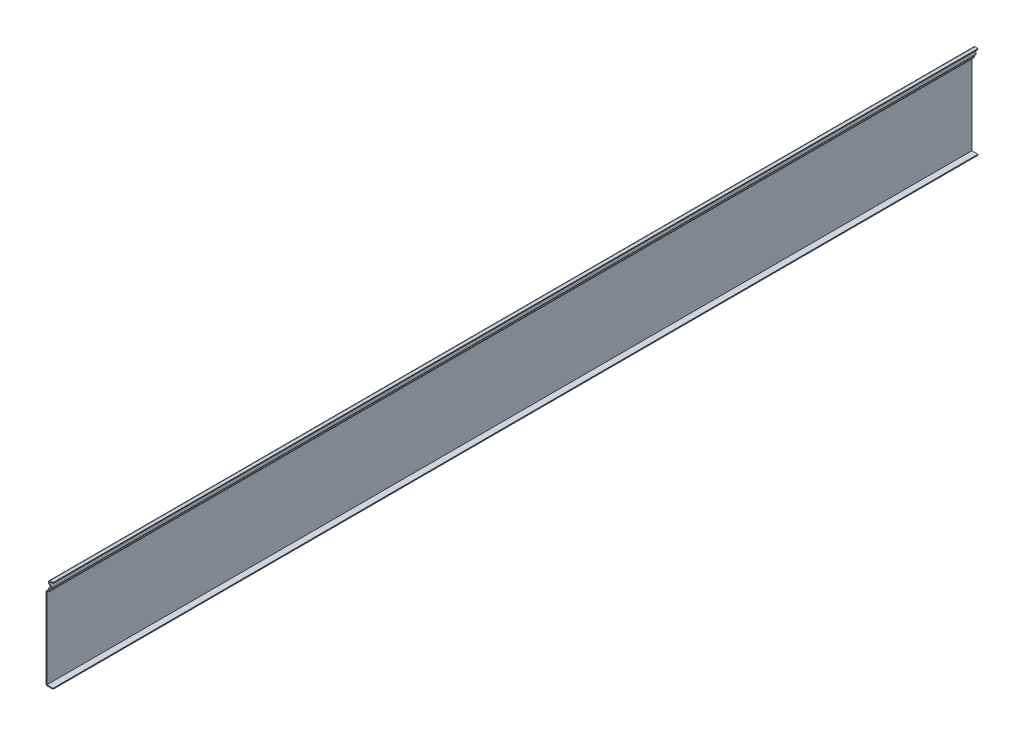
ISO-10303-21;
HEADER;
FILE_DESCRIPTION(('STEP AP214'),'2;1');
FILE_NAME('part.step','',(''),(''),'','','');
FILE_SCHEMA(('AUTOMOTIVE_DESIGN { 1 0 10303 214 1 1 1 1 }'));
ENDSEC;
DATA;
#1=APPLICATION_CONTEXT('core data for automotive mechanical design processes');
#2=APPLICATION_PROTOCOL_DEFINITION('international standard','automotive_design',2000,#1);
#3=PRODUCT_CONTEXT('',#1,'mechanical');
#4=PRODUCT('Part','Part','',(#3));
#5=PRODUCT_RELATED_PRODUCT_CATEGORY('part','',(#4));
#6=PRODUCT_DEFINITION_FORMATION('','',#4);
#7=PRODUCT_DEFINITION_CONTEXT('part definition',#1,'design');
#8=PRODUCT_DEFINITION('design','',#6,#7);
#9=PRODUCT_DEFINITION_SHAPE('','',#8);
#10=(LENGTH_UNIT() NAMED_UNIT(*) SI_UNIT(.MILLI.,.METRE.));
#11=(NAMED_UNIT(*) PLANE_ANGLE_UNIT() SI_UNIT($,.RADIAN.));
#12=(NAMED_UNIT(*) SI_UNIT($,.STERADIAN.) SOLID_ANGLE_UNIT());
#13=UNCERTAINTY_MEASURE_WITH_UNIT(LENGTH_MEASURE(1.E-05),#10,'distance_accuracy_value','');
#14=(GEOMETRIC_REPRESENTATION_CONTEXT(3) GLOBAL_UNCERTAINTY_ASSIGNED_CONTEXT((#13)) GLOBAL_UNIT_ASSIGNED_CONTEXT((#10,
#11,#12)) REPRESENTATION_CONTEXT('',''));
#15=CARTESIAN_POINT('',(0.,0.,0.));
#16=DIRECTION('',(0.,0.,1.));
#17=DIRECTION('',(1.,0.,0.));
#18=AXIS2_PLACEMENT_3D('',#15,#16,#17);
#19=CARTESIAN_POINT('',(-3.79778394209355,124.1425,-1254.125));
#20=DIRECTION('',(0.,-1.,0.));
#21=DIRECTION('',(0.,0.,-1.));
#22=AXIS2_PLACEMENT_3D('',#19,#20,#21);
#23=PLANE('',#22);
#24=DIRECTION('',(1.,0.,0.));
#25=VECTOR('',#24,1.);
#26=CARTESIAN_POINT('',(-3.79778394209355,124.1425,0.));
#27=LINE('',#26,#25);
#28=CARTESIAN_POINT('',(-3.79778394209355,124.1425,0.));
#29=VERTEX_POINT('',#28);
#30=CARTESIAN_POINT('',(0.,124.1425,0.));
#31=VERTEX_POINT('',#30);
#32=EDGE_CURVE('E227',#29,#31,#27,.T.);
#33=ORIENTED_EDGE('',*,*,#32,.F.);
#34=DIRECTION('',(0.,0.,1.));
#35=VECTOR('',#34,1.);
#36=CARTESIAN_POINT('',(-3.79778394209355,124.1425,-1254.125));
#37=LINE('',#36,#35);
#38=CARTESIAN_POINT('',(-3.79778394209355,124.1425,-1254.125));
#39=VERTEX_POINT('',#38);
#40=EDGE_CURVE('E190',#39,#29,#37,.T.);
#41=ORIENTED_EDGE('',*,*,#40,.F.);
#42=DIRECTION('',(1.,0.,0.));
#43=VECTOR('',#42,1.);
#44=CARTESIAN_POINT('',(-3.79778394209355,124.1425,-1254.125));
#45=LINE('',#44,#43);
#46=CARTESIAN_POINT('',(0.,124.1425,-1254.125));
#47=VERTEX_POINT('',#46);
#48=EDGE_CURVE('E171',#39,#47,#45,.T.);
#49=ORIENTED_EDGE('',*,*,#48,.T.);
#50=DIRECTION('',(0.,0.,1.));
#51=VECTOR('',#50,1.);
#52=CARTESIAN_POINT('',(0.,124.1425,-1254.125));
#53=LINE('',#52,#51);
#54=EDGE_CURVE('E180',#47,#31,#53,.T.);
#55=ORIENTED_EDGE('',*,*,#54,.T.);
#56=EDGE_LOOP('',(#33,#41,#49,#55));
#57=FACE_BOUND('',#56,.T.);
#58=ADVANCED_FACE('F35',(#57),#23,.T.);
#59=CARTESIAN_POINT('',(-3.79778394209355,122.860283942094,-1254.125));
#60=DIRECTION('',(0.,0.,1.));
#61=DIRECTION('',(1.,0.,0.));
#62=AXIS2_PLACEMENT_3D('',#59,#60,#61);
#63=CYLINDRICAL_SURFACE('',#62,1.28221605790645);
#64=CARTESIAN_POINT('',(-3.79778394209355,122.860283942094,0.));
#65=DIRECTION('',(0.,0.,1.));
#66=DIRECTION('',(1.,0.,0.));
#67=AXIS2_PLACEMENT_3D('',#64,#65,#66);
#68=CIRCLE('',#67,1.28221605790645);
#69=CARTESIAN_POINT('',(-4.43889197104677,121.749852262806,0.));
#70=VERTEX_POINT('',#69);
#71=EDGE_CURVE('E191',#70,#29,#68,.F.);
#72=ORIENTED_EDGE('',*,*,#71,.F.);
#73=DIRECTION('',(0.,0.,1.));
#74=VECTOR('',#73,1.);
#75=CARTESIAN_POINT('',(-4.43889197104677,121.749852262806,-1254.125));
#76=LINE('',#75,#74);
#77=CARTESIAN_POINT('',(-4.43889197104677,121.749852262806,-1254.125));
#78=VERTEX_POINT('',#77);
#79=EDGE_CURVE('E262',#78,#70,#76,.T.);
#80=ORIENTED_EDGE('',*,*,#79,.F.);
#81=CARTESIAN_POINT('',(-3.79778394209355,122.860283942094,-1254.125));
#82=DIRECTION('',(0.,0.,1.));
#83=DIRECTION('',(1.,0.,0.));
#84=AXIS2_PLACEMENT_3D('',#81,#82,#83);
#85=CIRCLE('',#84,1.28221605790645);
#86=EDGE_CURVE('E188',#78,#39,#85,.F.);
#87=ORIENTED_EDGE('',*,*,#86,.T.);
#88=ORIENTED_EDGE('',*,*,#40,.T.);
#89=EDGE_LOOP('',(#72,#80,#87,#88));
#90=FACE_BOUND('',#89,.T.);
#91=ADVANCED_FACE('F330',(#90),#63,.F.);
#92=CARTESIAN_POINT('',(-6.35,118.439716057906,-1254.125));
#93=DIRECTION('',(0.,0.,1.));
#94=DIRECTION('',(1.,0.,0.));
#95=AXIS2_PLACEMENT_3D('',#92,#93,#94);
#96=CYLINDRICAL_SURFACE('',#95,3.82221605790645);
#97=CARTESIAN_POINT('',(-6.35,118.439716057906,0.));
#98=DIRECTION('',(0.,0.,1.));
#99=DIRECTION('',(1.,0.,0.));
#100=AXIS2_PLACEMENT_3D('',#97,#98,#99);
#101=CIRCLE('',#100,3.82221605790645);
#102=CARTESIAN_POINT('',(-5.08,114.834659110601,0.));
#103=VERTEX_POINT('',#102);
#104=EDGE_CURVE('E194',#103,#70,#101,.T.);
#105=ORIENTED_EDGE('',*,*,#104,.F.);
#106=DIRECTION('',(0.,0.,1.));
#107=VECTOR('',#106,1.);
#108=CARTESIAN_POINT('',(-5.08,114.834659110601,-1254.125));
#109=LINE('',#108,#107);
#110=CARTESIAN_POINT('',(-5.08,114.834659110601,-1254.125));
#111=VERTEX_POINT('',#110);
#112=EDGE_CURVE('E264',#111,#103,#109,.T.);
#113=ORIENTED_EDGE('',*,*,#112,.F.);
#114=CARTESIAN_POINT('',(-6.35,118.439716057906,-1254.125));
#115=DIRECTION('',(0.,0.,1.));
#116=DIRECTION('',(1.,0.,0.));
#117=AXIS2_PLACEMENT_3D('',#114,#115,#116);
#118=CIRCLE('',#117,3.82221605790645);
#119=EDGE_CURVE('E223',#111,#78,#118,.T.);
#120=ORIENTED_EDGE('',*,*,#119,.T.);
#121=ORIENTED_EDGE('',*,*,#79,.T.);
#122=EDGE_LOOP('',(#105,#113,#120,#121));
#123=FACE_BOUND('',#122,.T.);
#124=ADVANCED_FACE('F336',(#123),#96,.T.);
#125=CARTESIAN_POINT('',(-5.08,112.7125,-1254.125));
#126=DIRECTION('',(1.,0.,0.));
#127=DIRECTION('',(0.,1.,0.));
#128=AXIS2_PLACEMENT_3D('',#125,#126,#127);
#129=PLANE('',#128);
#130=DIRECTION('',(0.,1.,0.));
#131=VECTOR('',#130,1.);
#132=CARTESIAN_POINT('',(-5.08,112.7125,0.));
#133=LINE('',#132,#131);
#134=CARTESIAN_POINT('',(-5.08,112.7125,0.));
#135=VERTEX_POINT('',#134);
#136=EDGE_CURVE('E256',#135,#103,#133,.T.);
#137=ORIENTED_EDGE('',*,*,#136,.F.);
#138=DIRECTION('',(0.,0.,1.));
#139=VECTOR('',#138,1.);
#140=CARTESIAN_POINT('',(-5.08,112.7125,-1254.125));
#141=LINE('',#140,#139);
#142=CARTESIAN_POINT('',(-5.08,112.7125,-1254.125));
#143=VERTEX_POINT('',#142);
#144=EDGE_CURVE('E307',#135,#143,#141,.F.);
#145=ORIENTED_EDGE('',*,*,#144,.T.);
#146=DIRECTION('',(0.,1.,0.));
#147=VECTOR('',#146,1.);
#148=CARTESIAN_POINT('',(-5.08,112.7125,-1254.125));
#149=LINE('',#148,#147);
#150=EDGE_CURVE('E221',#143,#111,#149,.T.);
#151=ORIENTED_EDGE('',*,*,#150,.T.);
#152=ORIENTED_EDGE('',*,*,#112,.T.);
#153=EDGE_LOOP('',(#137,#145,#151,#152));
#154=FACE_BOUND('',#153,.T.);
#155=ADVANCED_FACE('F339',(#154),#129,.T.);
#156=CARTESIAN_POINT('',(-6.35,109.5375,-1254.125));
#157=DIRECTION('',(0.,0.,1.));
#158=DIRECTION('',(1.,0.,0.));
#159=AXIS2_PLACEMENT_3D('',#156,#157,#158);
#160=CYLINDRICAL_SURFACE('',#159,1.90500000000004);
#161=CARTESIAN_POINT('',(-6.35,109.5375,-1254.125));
#162=DIRECTION('',(0.,0.,1.));
#163=DIRECTION('',(1.,0.,0.));
#164=AXIS2_PLACEMENT_3D('',#161,#162,#163);
#165=CIRCLE('',#164,1.90500000000004);
#166=CARTESIAN_POINT('',(-8.25500000000004,109.5375,-1254.125));
#167=VERTEX_POINT('',#166);
#168=CARTESIAN_POINT('',(-6.35,111.4425,-1254.125));
#169=VERTEX_POINT('',#168);
#170=EDGE_CURVE('E218',#167,#169,#165,.F.);
#171=ORIENTED_EDGE('',*,*,#170,.T.);
#172=DIRECTION('',(0.,0.,1.));
#173=VECTOR('',#172,1.);
#174=CARTESIAN_POINT('',(-6.35,111.4425,-1254.125));
#175=LINE('',#174,#173);
#176=CARTESIAN_POINT('',(-6.35,111.4425,0.));
#177=VERTEX_POINT('',#176);
#178=EDGE_CURVE('E304',#169,#177,#175,.T.);
#179=ORIENTED_EDGE('',*,*,#178,.T.);
#180=CARTESIAN_POINT('',(-6.35,109.5375,0.));
#181=DIRECTION('',(0.,0.,1.));
#182=DIRECTION('',(1.,0.,0.));
#183=AXIS2_PLACEMENT_3D('',#180,#181,#182);
#184=CIRCLE('',#183,1.90500000000004);
#185=CARTESIAN_POINT('',(-8.25500000000004,109.5375,0.));
#186=VERTEX_POINT('',#185);
#187=EDGE_CURVE('E253',#186,#177,#184,.F.);
#188=ORIENTED_EDGE('',*,*,#187,.F.);
#189=DIRECTION('',(0.,0.,1.));
#190=VECTOR('',#189,1.);
#191=CARTESIAN_POINT('',(-8.25500000000004,109.5375,-1254.125));
#192=LINE('',#191,#190);
#193=EDGE_CURVE('E267',#167,#186,#192,.T.);
#194=ORIENTED_EDGE('',*,*,#193,.F.);
#195=EDGE_LOOP('',(#171,#179,#188,#194));
#196=FACE_BOUND('',#195,.T.);
#197=ADVANCED_FACE('F347',(#196),#160,.F.);
#198=CARTESIAN_POINT('',(-8.255,0.,-1254.125));
#199=DIRECTION('',(1.,0.,0.));
#200=DIRECTION('',(0.,0.,-1.));
#201=AXIS2_PLACEMENT_3D('',#198,#199,#200);
#202=PLANE('',#201);
#203=DIRECTION('',(0.,1.,0.));
#204=VECTOR('',#203,1.);
#205=CARTESIAN_POINT('',(-8.255,0.,0.));
#206=LINE('',#205,#204);
#207=CARTESIAN_POINT('',(-8.255,1.27,0.));
#208=VERTEX_POINT('',#207);
#209=EDGE_CURVE('E250',#208,#186,#206,.T.);
#210=ORIENTED_EDGE('',*,*,#209,.F.);
#211=DIRECTION('',(0.,0.,1.));
#212=VECTOR('',#211,1.);
#213=CARTESIAN_POINT('',(-8.255,1.27,-1254.125));
#214=LINE('',#213,#212);
#215=CARTESIAN_POINT('',(-8.255,1.27,-1254.125));
#216=VERTEX_POINT('',#215);
#217=EDGE_CURVE('E269',#216,#208,#214,.T.);
#218=ORIENTED_EDGE('',*,*,#217,.F.);
#219=DIRECTION('',(0.,1.,0.));
#220=VECTOR('',#219,1.);
#221=CARTESIAN_POINT('',(-8.255,0.,-1254.125));
#222=LINE('',#221,#220);
#223=EDGE_CURVE('E215',#216,#167,#222,.T.);
#224=ORIENTED_EDGE('',*,*,#223,.T.);
#225=ORIENTED_EDGE('',*,*,#193,.T.);
#226=EDGE_LOOP('',(#210,#218,#224,#225));
#227=FACE_BOUND('',#226,.T.);
#228=ADVANCED_FACE('F351',(#227),#202,.T.);
#229=CARTESIAN_POINT('',(0.,1.27,-1254.125));
#230=DIRECTION('',(0.,1.,0.));
#231=DIRECTION('',(0.,0.,1.));
#232=AXIS2_PLACEMENT_3D('',#229,#230,#231);
#233=PLANE('',#232);
#234=DIRECTION('',(1.,0.,0.));
#235=VECTOR('',#234,1.);
#236=CARTESIAN_POINT('',(0.,1.27,0.));
#237=LINE('',#236,#235);
#238=CARTESIAN_POINT('',(0.,1.27,0.));
#239=VERTEX_POINT('',#238);
#240=EDGE_CURVE('E247',#239,#208,#237,.F.);
#241=ORIENTED_EDGE('',*,*,#240,.F.);
#242=DIRECTION('',(0.,0.,1.));
#243=VECTOR('',#242,1.);
#244=CARTESIAN_POINT('',(0.,1.27,-1254.125));
#245=LINE('',#244,#243);
#246=CARTESIAN_POINT('',(0.,1.27,-1254.125));
#247=VERTEX_POINT('',#246);
#248=EDGE_CURVE('E271',#247,#239,#245,.T.);
#249=ORIENTED_EDGE('',*,*,#248,.F.);
#250=DIRECTION('',(1.,0.,0.));
#251=VECTOR('',#250,1.);
#252=CARTESIAN_POINT('',(0.,1.27,-1254.125));
#253=LINE('',#252,#251);
#254=EDGE_CURVE('E212',#247,#216,#253,.F.);
#255=ORIENTED_EDGE('',*,*,#254,.T.);
#256=ORIENTED_EDGE('',*,*,#217,.T.);
#257=EDGE_LOOP('',(#241,#249,#255,#256));
#258=FACE_BOUND('',#257,.T.);
#259=ADVANCED_FACE('F355',(#258),#233,.T.);
#260=CARTESIAN_POINT('',(0.,1.27,-1254.125));
#261=DIRECTION('',(-1.,0.,0.));
#262=DIRECTION('',(0.,0.,1.));
#263=AXIS2_PLACEMENT_3D('',#260,#261,#262);
#264=PLANE('',#263);
#265=DIRECTION('',(0.,-1.,0.));
#266=VECTOR('',#265,1.);
#267=CARTESIAN_POINT('',(0.,1.27,0.));
#268=LINE('',#267,#266);
#269=CARTESIAN_POINT('',(0.,0.,0.));
#270=VERTEX_POINT('',#269);
#271=EDGE_CURVE('E245',#239,#270,#268,.T.);
#272=ORIENTED_EDGE('',*,*,#271,.T.);
#273=DIRECTION('',(0.,0.,1.));
#274=VECTOR('',#273,1.);
#275=CARTESIAN_POINT('',(0.,0.,-1254.125));
#276=LINE('',#275,#274);
#277=CARTESIAN_POINT('',(0.,0.,-1254.125));
#278=VERTEX_POINT('',#277);
#279=EDGE_CURVE('E273',#278,#270,#276,.T.);
#280=ORIENTED_EDGE('',*,*,#279,.F.);
#281=DIRECTION('',(0.,-1.,0.));
#282=VECTOR('',#281,1.);
#283=CARTESIAN_POINT('',(0.,1.27,-1254.125));
#284=LINE('',#283,#282);
#285=EDGE_CURVE('E210',#247,#278,#284,.T.);
#286=ORIENTED_EDGE('',*,*,#285,.F.);
#287=ORIENTED_EDGE('',*,*,#248,.T.);
#288=EDGE_LOOP('',(#272,#280,#286,#287));
#289=FACE_BOUND('',#288,.T.);
#290=ADVANCED_FACE('F360',(#289),#264,.F.);
#291=CARTESIAN_POINT('',(0.,0.,-1254.125));
#292=DIRECTION('',(0.,1.,0.));
#293=DIRECTION('',(0.,0.,1.));
#294=AXIS2_PLACEMENT_3D('',#291,#292,#293);
#295=PLANE('',#294);
#296=DIRECTION('',(-1.,0.,0.));
#297=VECTOR('',#296,1.);
#298=CARTESIAN_POINT('',(0.,0.,0.));
#299=LINE('',#298,#297);
#300=CARTESIAN_POINT('',(-8.255,0.,0.));
#301=VERTEX_POINT('',#300);
#302=EDGE_CURVE('E242',#270,#301,#299,.T.);
#303=ORIENTED_EDGE('',*,*,#302,.T.);
#304=DIRECTION('',(0.,0.,1.));
#305=VECTOR('',#304,1.);
#306=CARTESIAN_POINT('',(-8.255,0.,-1254.125));
#307=LINE('',#306,#305);
#308=CARTESIAN_POINT('',(-8.255,0.,-1254.125));
#309=VERTEX_POINT('',#308);
#310=EDGE_CURVE('E297',#301,#309,#307,.F.);
#311=ORIENTED_EDGE('',*,*,#310,.T.);
#312=DIRECTION('',(-1.,0.,0.));
#313=VECTOR('',#312,1.);
#314=CARTESIAN_POINT('',(0.,0.,-1254.125));
#315=LINE('',#314,#313);
#316=EDGE_CURVE('E208',#278,#309,#315,.T.);
#317=ORIENTED_EDGE('',*,*,#316,.F.);
#318=ORIENTED_EDGE('',*,*,#279,.T.);
#319=EDGE_LOOP('',(#303,#311,#317,#318));
#320=FACE_BOUND('',#319,.T.);
#321=ADVANCED_FACE('F414',(#320),#295,.F.);
#322=CARTESIAN_POINT('',(-9.525,0.,-1254.125));
#323=DIRECTION('',(1.,0.,0.));
#324=DIRECTION('',(0.,0.,-1.));
#325=AXIS2_PLACEMENT_3D('',#322,#323,#324);
#326=PLANE('',#325);
#327=DIRECTION('',(0.,1.,0.));
#328=VECTOR('',#327,1.);
#329=CARTESIAN_POINT('',(-9.525,0.,-1254.125));
#330=LINE('',#329,#328);
#331=CARTESIAN_POINT('',(-9.525,1.27,-1254.125));
#332=VERTEX_POINT('',#331);
#333=CARTESIAN_POINT('',(-9.525,109.5375,-1254.125));
#334=VERTEX_POINT('',#333);
#335=EDGE_CURVE('E206',#332,#334,#330,.T.);
#336=ORIENTED_EDGE('',*,*,#335,.F.);
#337=DIRECTION('',(0.,0.,1.));
#338=VECTOR('',#337,1.);
#339=CARTESIAN_POINT('',(-9.525,1.27,-1254.125));
#340=LINE('',#339,#338);
#341=CARTESIAN_POINT('',(-9.525,1.27,0.));
#342=VERTEX_POINT('',#341);
#343=EDGE_CURVE('E261',#332,#342,#340,.T.);
#344=ORIENTED_EDGE('',*,*,#343,.T.);
#345=DIRECTION('',(0.,1.,0.));
#346=VECTOR('',#345,1.);
#347=CARTESIAN_POINT('',(-9.525,0.,0.));
#348=LINE('',#347,#346);
#349=CARTESIAN_POINT('',(-9.525,109.5375,0.));
#350=VERTEX_POINT('',#349);
#351=EDGE_CURVE('E240',#342,#350,#348,.T.);
#352=ORIENTED_EDGE('',*,*,#351,.T.);
#353=DIRECTION('',(0.,0.,1.));
#354=VECTOR('',#353,1.);
#355=CARTESIAN_POINT('',(-9.525,109.5375,-1254.125));
#356=LINE('',#355,#354);
#357=EDGE_CURVE('E276',#334,#350,#356,.T.);
#358=ORIENTED_EDGE('',*,*,#357,.F.);
#359=EDGE_LOOP('',(#336,#344,#352,#358));
#360=FACE_BOUND('',#359,.T.);
#361=ADVANCED_FACE('F370',(#360),#326,.F.);
#362=CARTESIAN_POINT('',(-6.35,109.5375,-1254.125));
#363=DIRECTION('',(0.,0.,1.));
#364=DIRECTION('',(1.,0.,0.));
#365=AXIS2_PLACEMENT_3D('',#362,#363,#364);
#366=CYLINDRICAL_SURFACE('',#365,3.17500000000004);
#367=CARTESIAN_POINT('',(-6.35,109.5375,0.));
#368=DIRECTION('',(0.,0.,-1.));
#369=DIRECTION('',(-1.,0.,0.));
#370=AXIS2_PLACEMENT_3D('',#367,#368,#369);
#371=CIRCLE('',#370,3.17500000000004);
#372=CARTESIAN_POINT('',(-6.35,112.7125,0.));
#373=VERTEX_POINT('',#372);
#374=EDGE_CURVE('E238',#350,#373,#371,.T.);
#375=ORIENTED_EDGE('',*,*,#374,.T.);
#376=DIRECTION('',(0.,0.,1.));
#377=VECTOR('',#376,1.);
#378=CARTESIAN_POINT('',(-6.35,112.7125,-1254.125));
#379=LINE('',#378,#377);
#380=CARTESIAN_POINT('',(-6.35,112.7125,-1254.125));
#381=VERTEX_POINT('',#380);
#382=EDGE_CURVE('E279',#381,#373,#379,.T.);
#383=ORIENTED_EDGE('',*,*,#382,.F.);
#384=CARTESIAN_POINT('',(-6.35,109.5375,-1254.125));
#385=DIRECTION('',(0.,0.,-1.));
#386=DIRECTION('',(-1.,0.,0.));
#387=AXIS2_PLACEMENT_3D('',#384,#385,#386);
#388=CIRCLE('',#387,3.17500000000004);
#389=EDGE_CURVE('E204',#334,#381,#388,.T.);
#390=ORIENTED_EDGE('',*,*,#389,.F.);
#391=ORIENTED_EDGE('',*,*,#357,.T.);
#392=EDGE_LOOP('',(#375,#383,#390,#391));
#393=FACE_BOUND('',#392,.T.);
#394=ADVANCED_FACE('F376',(#393),#366,.T.);
#395=CARTESIAN_POINT('',(-6.35,112.7125,-1254.125));
#396=DIRECTION('',(1.,0.,0.));
#397=DIRECTION('',(0.,1.,0.));
#398=AXIS2_PLACEMENT_3D('',#395,#396,#397);
#399=PLANE('',#398);
#400=DIRECTION('',(0.,1.,0.));
#401=VECTOR('',#400,1.);
#402=CARTESIAN_POINT('',(-6.35,112.7125,0.));
#403=LINE('',#402,#401);
#404=CARTESIAN_POINT('',(-6.35,114.834659110601,0.));
#405=VERTEX_POINT('',#404);
#406=EDGE_CURVE('E236',#373,#405,#403,.T.);
#407=ORIENTED_EDGE('',*,*,#406,.T.);
#408=DIRECTION('',(0.,0.,1.));
#409=VECTOR('',#408,1.);
#410=CARTESIAN_POINT('',(-6.35,114.834659110601,-1254.125));
#411=LINE('',#410,#409);
#412=CARTESIAN_POINT('',(-6.35,114.834659110601,-1254.125));
#413=VERTEX_POINT('',#412);
#414=EDGE_CURVE('E11',#405,#413,#411,.F.);
#415=ORIENTED_EDGE('',*,*,#414,.T.);
#416=DIRECTION('',(0.,1.,0.));
#417=VECTOR('',#416,1.);
#418=CARTESIAN_POINT('',(-6.35,112.7125,-1254.125));
#419=LINE('',#418,#417);
#420=EDGE_CURVE('E202',#381,#413,#419,.T.);
#421=ORIENTED_EDGE('',*,*,#420,.F.);
#422=ORIENTED_EDGE('',*,*,#382,.T.);
#423=EDGE_LOOP('',(#407,#415,#421,#422));
#424=FACE_BOUND('',#423,.T.);
#425=ADVANCED_FACE('F378',(#424),#399,.F.);
#426=CARTESIAN_POINT('',(-6.35,118.439716057906,-1254.125));
#427=DIRECTION('',(0.,0.,1.));
#428=DIRECTION('',(1.,0.,0.));
#429=AXIS2_PLACEMENT_3D('',#426,#427,#428);
#430=CYLINDRICAL_SURFACE('',#429,2.55221605790645);
#431=CARTESIAN_POINT('',(-6.35,118.439716057906,-1254.125));
#432=DIRECTION('',(0.,0.,1.));
#433=DIRECTION('',(1.,0.,0.));
#434=AXIS2_PLACEMENT_3D('',#431,#432,#433);
#435=CIRCLE('',#434,2.55221605790645);
#436=CARTESIAN_POINT('',(-5.50198033171454,116.032504092076,-1254.125));
#437=VERTEX_POINT('',#436);
#438=CARTESIAN_POINT('',(-5.07389197104678,120.65,-1254.125));
#439=VERTEX_POINT('',#438);
#440=EDGE_CURVE('E200',#437,#439,#435,.T.);
#441=ORIENTED_EDGE('',*,*,#440,.F.);
#442=DIRECTION('',(0.,0.,1.));
#443=VECTOR('',#442,1.);
#444=CARTESIAN_POINT('',(-5.50198033171454,116.032504092076,-1254.125));
#445=LINE('',#444,#443);
#446=CARTESIAN_POINT('',(-5.50198033171454,116.032504092076,0.));
#447=VERTEX_POINT('',#446);
#448=EDGE_CURVE('E43',#437,#447,#445,.T.);
#449=ORIENTED_EDGE('',*,*,#448,.T.);
#450=CARTESIAN_POINT('',(-6.35,118.439716057906,0.));
#451=DIRECTION('',(0.,0.,1.));
#452=DIRECTION('',(1.,0.,0.));
#453=AXIS2_PLACEMENT_3D('',#450,#451,#452);
#454=CIRCLE('',#453,2.55221605790645);
#455=CARTESIAN_POINT('',(-5.07389197104678,120.65,0.));
#456=VERTEX_POINT('',#455);
#457=EDGE_CURVE('E234',#447,#456,#454,.T.);
#458=ORIENTED_EDGE('',*,*,#457,.T.);
#459=DIRECTION('',(0.,0.,1.));
#460=VECTOR('',#459,1.);
#461=CARTESIAN_POINT('',(-5.07389197104678,120.65,-1254.125));
#462=LINE('',#461,#460);
#463=EDGE_CURVE('E282',#439,#456,#462,.T.);
#464=ORIENTED_EDGE('',*,*,#463,.F.);
#465=EDGE_LOOP('',(#441,#449,#458,#464));
#466=FACE_BOUND('',#465,.T.);
#467=ADVANCED_FACE('F312',(#466),#430,.F.);
#468=CARTESIAN_POINT('',(-3.79778394209355,122.860283942094,-1254.125));
#469=DIRECTION('',(0.,0.,1.));
#470=DIRECTION('',(1.,0.,0.));
#471=AXIS2_PLACEMENT_3D('',#468,#469,#470);
#472=CYLINDRICAL_SURFACE('',#471,2.55221605790645);
#473=CARTESIAN_POINT('',(-3.79778394209355,122.860283942094,0.));
#474=DIRECTION('',(0.,0.,-1.));
#475=DIRECTION('',(-1.,0.,0.));
#476=AXIS2_PLACEMENT_3D('',#473,#474,#475);
#477=CIRCLE('',#476,2.55221605790645);
#478=CARTESIAN_POINT('',(-3.79778394209355,125.4125,0.));
#479=VERTEX_POINT('',#478);
#480=EDGE_CURVE('E232',#456,#479,#477,.T.);
#481=ORIENTED_EDGE('',*,*,#480,.T.);
#482=DIRECTION('',(0.,0.,1.));
#483=VECTOR('',#482,1.);
#484=CARTESIAN_POINT('',(-3.79778394209355,125.4125,-1254.125));
#485=LINE('',#484,#483);
#486=CARTESIAN_POINT('',(-3.79778394209355,125.4125,-1254.125));
#487=VERTEX_POINT('',#486);
#488=EDGE_CURVE('E285',#487,#479,#485,.T.);
#489=ORIENTED_EDGE('',*,*,#488,.F.);
#490=CARTESIAN_POINT('',(-3.79778394209355,122.860283942094,-1254.125));
#491=DIRECTION('',(0.,0.,-1.));
#492=DIRECTION('',(-1.,0.,0.));
#493=AXIS2_PLACEMENT_3D('',#490,#491,#492);
#494=CIRCLE('',#493,2.55221605790645);
#495=EDGE_CURVE('E198',#439,#487,#494,.T.);
#496=ORIENTED_EDGE('',*,*,#495,.F.);
#497=ORIENTED_EDGE('',*,*,#463,.T.);
#498=EDGE_LOOP('',(#481,#489,#496,#497));
#499=FACE_BOUND('',#498,.T.);
#500=ADVANCED_FACE('F323',(#499),#472,.T.);
#501=CARTESIAN_POINT('',(-3.79778394209355,125.4125,-1254.125));
#502=DIRECTION('',(0.,-1.,0.));
#503=DIRECTION('',(0.,0.,-1.));
#504=AXIS2_PLACEMENT_3D('',#501,#502,#503);
#505=PLANE('',#504);
#506=DIRECTION('',(1.,0.,0.));
#507=VECTOR('',#506,1.);
#508=CARTESIAN_POINT('',(-3.79778394209355,125.4125,0.));
#509=LINE('',#508,#507);
#510=CARTESIAN_POINT('',(0.,125.4125,0.));
#511=VERTEX_POINT('',#510);
#512=EDGE_CURVE('E230',#479,#511,#509,.T.);
#513=ORIENTED_EDGE('',*,*,#512,.T.);
#514=DIRECTION('',(0.,0.,1.));
#515=VECTOR('',#514,1.);
#516=CARTESIAN_POINT('',(0.,125.4125,-1254.125));
#517=LINE('',#516,#515);
#518=CARTESIAN_POINT('',(0.,125.4125,-1254.125));
#519=VERTEX_POINT('',#518);
#520=EDGE_CURVE('E187',#519,#511,#517,.T.);
#521=ORIENTED_EDGE('',*,*,#520,.F.);
#522=DIRECTION('',(1.,0.,0.));
#523=VECTOR('',#522,1.);
#524=CARTESIAN_POINT('',(-3.79778394209355,125.4125,-1254.125));
#525=LINE('',#524,#523);
#526=EDGE_CURVE('E174',#487,#519,#525,.T.);
#527=ORIENTED_EDGE('',*,*,#526,.F.);
#528=ORIENTED_EDGE('',*,*,#488,.T.);
#529=EDGE_LOOP('',(#513,#521,#527,#528));
#530=FACE_BOUND('',#529,.T.);
#531=ADVANCED_FACE('F326',(#530),#505,.F.);
#532=CARTESIAN_POINT('',(0.,125.4125,-1254.125));
#533=DIRECTION('',(-1.,0.,0.));
#534=DIRECTION('',(0.,0.,1.));
#535=AXIS2_PLACEMENT_3D('',#532,#533,#534);
#536=PLANE('',#535);
#537=DIRECTION('',(0.,-1.,0.));
#538=VECTOR('',#537,1.);
#539=CARTESIAN_POINT('',(0.,125.4125,0.));
#540=LINE('',#539,#538);
#541=EDGE_CURVE('E183',#511,#31,#540,.T.);
#542=ORIENTED_EDGE('',*,*,#541,.T.);
#543=ORIENTED_EDGE('',*,*,#54,.F.);
#544=DIRECTION('',(0.,-1.,0.));
#545=VECTOR('',#544,1.);
#546=CARTESIAN_POINT('',(0.,125.4125,-1254.125));
#547=LINE('',#546,#545);
#548=EDGE_CURVE('E165',#519,#47,#547,.T.);
#549=ORIENTED_EDGE('',*,*,#548,.F.);
#550=ORIENTED_EDGE('',*,*,#520,.T.);
#551=EDGE_LOOP('',(#542,#543,#549,#550));
#552=FACE_BOUND('',#551,.T.);
#553=ADVANCED_FACE('F181',(#552),#536,.F.);
#554=CARTESIAN_POINT('',(-3.79778394209355,122.860283942094,-1254.125));
#555=DIRECTION('',(0.,0.,-1.));
#556=DIRECTION('',(-1.,0.,0.));
#557=AXIS2_PLACEMENT_3D('',#554,#555,#556);
#558=PLANE('',#557);
#559=ORIENTED_EDGE('',*,*,#316,.T.);
#560=CARTESIAN_POINT('',(-8.255,1.27,-1254.125));
#561=DIRECTION('',(0.,0.,-1.));
#562=DIRECTION('',(-1.,0.,0.));
#563=AXIS2_PLACEMENT_3D('',#560,#561,#562);
#564=CIRCLE('',#563,1.27);
#565=EDGE_CURVE('E302',#309,#332,#564,.T.);
#566=ORIENTED_EDGE('',*,*,#565,.T.);
#567=ORIENTED_EDGE('',*,*,#335,.T.);
#568=ORIENTED_EDGE('',*,*,#389,.T.);
#569=ORIENTED_EDGE('',*,*,#420,.T.);
#570=CARTESIAN_POINT('',(-5.08,114.834659110601,-1254.125));
#571=DIRECTION('',(0.,0.,-1.));
#572=DIRECTION('',(-1.,0.,0.));
#573=AXIS2_PLACEMENT_3D('',#570,#571,#572);
#574=CIRCLE('',#573,1.27);
#575=EDGE_CURVE('E50',#413,#437,#574,.T.);
#576=ORIENTED_EDGE('',*,*,#575,.T.);
#577=ORIENTED_EDGE('',*,*,#440,.T.);
#578=ORIENTED_EDGE('',*,*,#495,.T.);
#579=ORIENTED_EDGE('',*,*,#526,.T.);
#580=ORIENTED_EDGE('',*,*,#548,.T.);
#581=ORIENTED_EDGE('',*,*,#48,.F.);
#582=ORIENTED_EDGE('',*,*,#86,.F.);
#583=ORIENTED_EDGE('',*,*,#119,.F.);
#584=ORIENTED_EDGE('',*,*,#150,.F.);
#585=CARTESIAN_POINT('',(-6.35,112.7125,-1254.125));
#586=DIRECTION('',(0.,0.,-1.));
#587=DIRECTION('',(-1.,0.,0.));
#588=AXIS2_PLACEMENT_3D('',#585,#586,#587);
#589=CIRCLE('',#588,1.27);
#590=EDGE_CURVE('E300',#143,#169,#589,.T.);
#591=ORIENTED_EDGE('',*,*,#590,.T.);
#592=ORIENTED_EDGE('',*,*,#170,.F.);
#593=ORIENTED_EDGE('',*,*,#223,.F.);
#594=ORIENTED_EDGE('',*,*,#254,.F.);
#595=ORIENTED_EDGE('',*,*,#285,.T.);
#596=EDGE_LOOP('',(#559,#566,#567,#568,#569,#576,#577,#578,#579,#580,#581,#582,#583,#584,#591,
#592,#593,#594,#595));
#597=FACE_BOUND('',#596,.T.);
#598=ADVANCED_FACE('F168',(#597),#558,.T.);
#599=CARTESIAN_POINT('',(-3.79778394209355,122.860283942094,0.));
#600=DIRECTION('',(0.,0.,-1.));
#601=DIRECTION('',(-1.,0.,0.));
#602=AXIS2_PLACEMENT_3D('',#599,#600,#601);
#603=PLANE('',#602);
#604=ORIENTED_EDGE('',*,*,#351,.F.);
#605=CARTESIAN_POINT('',(-8.255,1.27,0.));
#606=DIRECTION('',(0.,0.,-1.));
#607=DIRECTION('',(-1.,0.,0.));
#608=AXIS2_PLACEMENT_3D('',#605,#606,#607);
#609=CIRCLE('',#608,1.27);
#610=EDGE_CURVE('E295',#342,#301,#609,.F.);
#611=ORIENTED_EDGE('',*,*,#610,.T.);
#612=ORIENTED_EDGE('',*,*,#302,.F.);
#613=ORIENTED_EDGE('',*,*,#271,.F.);
#614=ORIENTED_EDGE('',*,*,#240,.T.);
#615=ORIENTED_EDGE('',*,*,#209,.T.);
#616=ORIENTED_EDGE('',*,*,#187,.T.);
#617=CARTESIAN_POINT('',(-6.35,112.7125,0.));
#618=DIRECTION('',(0.,0.,-1.));
#619=DIRECTION('',(-1.,0.,0.));
#620=AXIS2_PLACEMENT_3D('',#617,#618,#619);
#621=CIRCLE('',#620,1.27);
#622=EDGE_CURVE('E293',#177,#135,#621,.F.);
#623=ORIENTED_EDGE('',*,*,#622,.T.);
#624=ORIENTED_EDGE('',*,*,#136,.T.);
#625=ORIENTED_EDGE('',*,*,#104,.T.);
#626=ORIENTED_EDGE('',*,*,#71,.T.);
#627=ORIENTED_EDGE('',*,*,#32,.T.);
#628=ORIENTED_EDGE('',*,*,#541,.F.);
#629=ORIENTED_EDGE('',*,*,#512,.F.);
#630=ORIENTED_EDGE('',*,*,#480,.F.);
#631=ORIENTED_EDGE('',*,*,#457,.F.);
#632=CARTESIAN_POINT('',(-5.08,114.834659110601,0.));
#633=DIRECTION('',(0.,0.,-1.));
#634=DIRECTION('',(-1.,0.,0.));
#635=AXIS2_PLACEMENT_3D('',#632,#633,#634);
#636=CIRCLE('',#635,1.27);
#637=EDGE_CURVE('E291',#447,#405,#636,.F.);
#638=ORIENTED_EDGE('',*,*,#637,.T.);
#639=ORIENTED_EDGE('',*,*,#406,.F.);
#640=ORIENTED_EDGE('',*,*,#374,.F.);
#641=EDGE_LOOP('',(#604,#611,#612,#613,#614,#615,#616,#623,#624,#625,#626,#627,#628,#629,#630,
#631,#638,#639,#640));
#642=FACE_BOUND('',#641,.T.);
#643=ADVANCED_FACE('F318',(#642),#603,.F.);
#644=CARTESIAN_POINT('',(-8.255,1.27,-1254.125));
#645=DIRECTION('',(0.,0.,1.));
#646=DIRECTION('',(1.,0.,0.));
#647=AXIS2_PLACEMENT_3D('',#644,#645,#646);
#648=CYLINDRICAL_SURFACE('',#647,1.27);
#649=ORIENTED_EDGE('',*,*,#565,.F.);
#650=ORIENTED_EDGE('',*,*,#310,.F.);
#651=ORIENTED_EDGE('',*,*,#610,.F.);
#652=ORIENTED_EDGE('',*,*,#343,.F.);
#653=EDGE_LOOP('',(#649,#650,#651,#652));
#654=FACE_BOUND('',#653,.T.);
#655=ADVANCED_FACE('F368',(#654),#648,.T.);
#656=CARTESIAN_POINT('',(-6.35,112.7125,-1254.125));
#657=DIRECTION('',(0.,0.,1.));
#658=DIRECTION('',(1.,0.,0.));
#659=AXIS2_PLACEMENT_3D('',#656,#657,#658);
#660=CYLINDRICAL_SURFACE('',#659,1.27);
#661=ORIENTED_EDGE('',*,*,#590,.F.);
#662=ORIENTED_EDGE('',*,*,#144,.F.);
#663=ORIENTED_EDGE('',*,*,#622,.F.);
#664=ORIENTED_EDGE('',*,*,#178,.F.);
#665=EDGE_LOOP('',(#661,#662,#663,#664));
#666=FACE_BOUND('',#665,.T.);
#667=ADVANCED_FACE('F342',(#666),#660,.T.);
#668=CARTESIAN_POINT('',(-5.08,114.834659110601,-1254.125));
#669=DIRECTION('',(0.,0.,1.));
#670=DIRECTION('',(1.,0.,0.));
#671=AXIS2_PLACEMENT_3D('',#668,#669,#670);
#672=CYLINDRICAL_SURFACE('',#671,1.27);
#673=ORIENTED_EDGE('',*,*,#575,.F.);
#674=ORIENTED_EDGE('',*,*,#414,.F.);
#675=ORIENTED_EDGE('',*,*,#637,.F.);
#676=ORIENTED_EDGE('',*,*,#448,.F.);
#677=EDGE_LOOP('',(#673,#674,#675,#676));
#678=FACE_BOUND('',#677,.T.);
#679=ADVANCED_FACE('F37',(#678),#672,.T.);
#680=CLOSED_SHELL('',(#58,#91,#124,#155,#197,#228,#259,#290,#321,#361,#394,#425,#467,#500,#531,
#553,#598,#643,#655,#667,#679));
#681=MANIFOLD_SOLID_BREP('B2',#680);
#682=ADVANCED_BREP_SHAPE_REPRESENTATION('',(#18,#681),#14);
#683=SHAPE_DEFINITION_REPRESENTATION(#9,#682);
ENDSEC;
END-ISO-10303-21;
